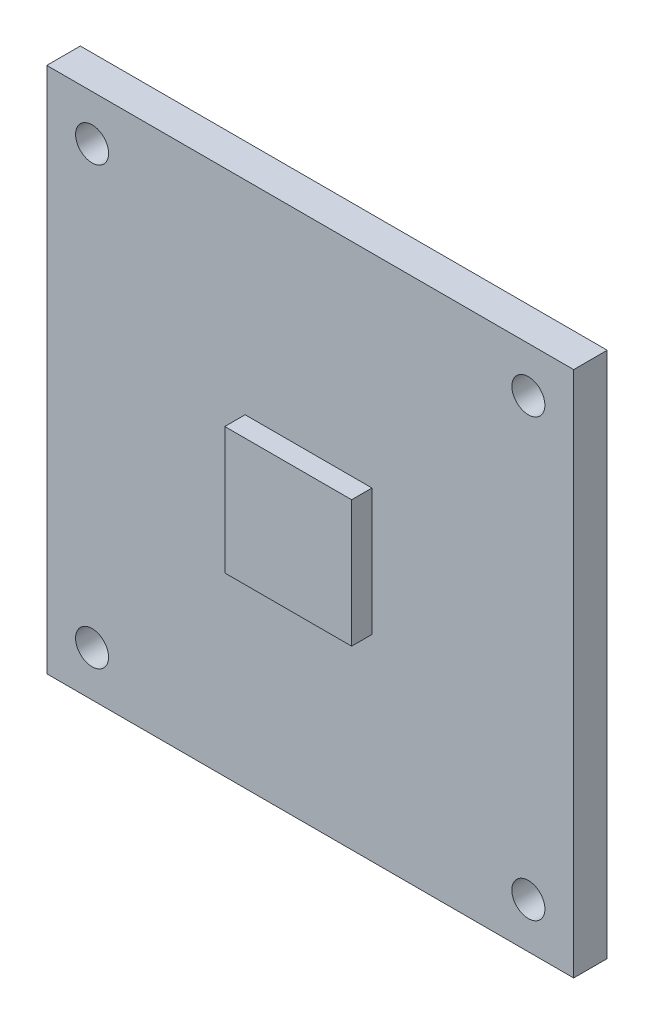
ISO-10303-21;
HEADER;
FILE_DESCRIPTION(('STEP AP214'),'2;1');
FILE_NAME('part.step','',(''),(''),'','','');
FILE_SCHEMA(('AUTOMOTIVE_DESIGN { 1 0 10303 214 1 1 1 1 }'));
ENDSEC;
DATA;
#1=APPLICATION_CONTEXT('core data for automotive mechanical design processes');
#2=APPLICATION_PROTOCOL_DEFINITION('international standard','automotive_design',2000,#1);
#3=PRODUCT_CONTEXT('',#1,'mechanical');
#4=PRODUCT('Part','Part','',(#3));
#5=PRODUCT_RELATED_PRODUCT_CATEGORY('part','',(#4));
#6=PRODUCT_DEFINITION_FORMATION('','',#4);
#7=PRODUCT_DEFINITION_CONTEXT('part definition',#1,'design');
#8=PRODUCT_DEFINITION('design','',#6,#7);
#9=PRODUCT_DEFINITION_SHAPE('','',#8);
#10=(LENGTH_UNIT() NAMED_UNIT(*) SI_UNIT(.MILLI.,.METRE.));
#11=(NAMED_UNIT(*) PLANE_ANGLE_UNIT() SI_UNIT($,.RADIAN.));
#12=(NAMED_UNIT(*) SI_UNIT($,.STERADIAN.) SOLID_ANGLE_UNIT());
#13=UNCERTAINTY_MEASURE_WITH_UNIT(LENGTH_MEASURE(1.E-05),#10,'distance_accuracy_value','');
#14=(GEOMETRIC_REPRESENTATION_CONTEXT(3) GLOBAL_UNCERTAINTY_ASSIGNED_CONTEXT((#13)) GLOBAL_UNIT_ASSIGNED_CONTEXT((#10,
#11,#12)) REPRESENTATION_CONTEXT('',''));
#15=CARTESIAN_POINT('',(0.,0.,0.));
#16=DIRECTION('',(0.,0.,1.));
#17=DIRECTION('',(1.,0.,0.));
#18=AXIS2_PLACEMENT_3D('',#15,#16,#17);
#19=CARTESIAN_POINT('',(0.,0.,0.));
#20=DIRECTION('',(0.,0.,1.));
#21=DIRECTION('',(1.,0.,0.));
#22=AXIS2_PLACEMENT_3D('',#19,#20,#21);
#23=PLANE('',#22);
#24=DIRECTION('',(0.,-1.,0.));
#25=VECTOR('',#24,1.);
#26=CARTESIAN_POINT('',(-3.42905,36.449,0.));
#27=LINE('',#26,#25);
#28=CARTESIAN_POINT('',(-3.42905,36.449,0.));
#29=VERTEX_POINT('',#28);
#30=CARTESIAN_POINT('',(-3.42905,-3.42905,0.));
#31=VERTEX_POINT('',#30);
#32=EDGE_CURVE('E160',#29,#31,#27,.T.);
#33=ORIENTED_EDGE('',*,*,#32,.T.);
#34=DIRECTION('',(1.,0.,0.));
#35=VECTOR('',#34,1.);
#36=CARTESIAN_POINT('',(-3.42905,-3.42905,0.));
#37=LINE('',#36,#35);
#38=CARTESIAN_POINT('',(36.449,-3.42905,0.));
#39=VERTEX_POINT('',#38);
#40=EDGE_CURVE('E173',#31,#39,#37,.T.);
#41=ORIENTED_EDGE('',*,*,#40,.T.);
#42=DIRECTION('',(0.,1.,0.));
#43=VECTOR('',#42,1.);
#44=CARTESIAN_POINT('',(36.449,36.449,0.));
#45=LINE('',#44,#43);
#46=CARTESIAN_POINT('',(36.449,36.449,0.));
#47=VERTEX_POINT('',#46);
#48=EDGE_CURVE('E176',#39,#47,#45,.T.);
#49=ORIENTED_EDGE('',*,*,#48,.T.);
#50=DIRECTION('',(-1.,0.,0.));
#51=VECTOR('',#50,1.);
#52=CARTESIAN_POINT('',(-3.42905,36.449,0.));
#53=LINE('',#52,#51);
#54=EDGE_CURVE('E164',#47,#29,#53,.T.);
#55=ORIENTED_EDGE('',*,*,#54,.T.);
#56=EDGE_LOOP('',(#33,#41,#49,#55));
#57=FACE_BOUND('',#56,.T.);
#58=CARTESIAN_POINT('',(0.,0.,0.));
#59=DIRECTION('',(0.,0.,1.));
#60=DIRECTION('',(1.,0.,0.));
#61=AXIS2_PLACEMENT_3D('',#58,#59,#60);
#62=CIRCLE('',#61,1.24999999999999);
#63=CARTESIAN_POINT('',(1.24999999999999,0.,0.));
#64=VERTEX_POINT('',#63);
#65=EDGE_CURVE('E154',#64,#64,#62,.T.);
#66=ORIENTED_EDGE('',*,*,#65,.F.);
#67=EDGE_LOOP('',(#66));
#68=FACE_BOUND('',#67,.T.);
#69=CARTESIAN_POINT('',(33.02,0.,0.));
#70=DIRECTION('',(0.,0.,1.));
#71=DIRECTION('',(1.,0.,0.));
#72=AXIS2_PLACEMENT_3D('',#69,#70,#71);
#73=CIRCLE('',#72,1.24999999999999);
#74=CARTESIAN_POINT('',(34.27,0.,0.));
#75=VERTEX_POINT('',#74);
#76=EDGE_CURVE('E148',#75,#75,#73,.T.);
#77=ORIENTED_EDGE('',*,*,#76,.F.);
#78=EDGE_LOOP('',(#77));
#79=FACE_BOUND('',#78,.T.);
#80=CARTESIAN_POINT('',(33.02,33.02,0.));
#81=DIRECTION('',(0.,0.,1.));
#82=DIRECTION('',(1.,0.,0.));
#83=AXIS2_PLACEMENT_3D('',#80,#81,#82);
#84=CIRCLE('',#83,1.24999999999999);
#85=CARTESIAN_POINT('',(34.27,33.02,0.));
#86=VERTEX_POINT('',#85);
#87=EDGE_CURVE('E142',#86,#86,#84,.T.);
#88=ORIENTED_EDGE('',*,*,#87,.F.);
#89=EDGE_LOOP('',(#88));
#90=FACE_BOUND('',#89,.T.);
#91=CARTESIAN_POINT('',(0.,33.02,0.));
#92=DIRECTION('',(0.,0.,1.));
#93=DIRECTION('',(1.,0.,0.));
#94=AXIS2_PLACEMENT_3D('',#91,#92,#93);
#95=CIRCLE('',#94,1.24999999999999);
#96=CARTESIAN_POINT('',(1.24999999999999,33.02,0.));
#97=VERTEX_POINT('',#96);
#98=EDGE_CURVE('E132',#97,#97,#95,.T.);
#99=ORIENTED_EDGE('',*,*,#98,.F.);
#100=EDGE_LOOP('',(#99));
#101=FACE_BOUND('',#100,.T.);
#102=DIRECTION('',(1.,0.,0.));
#103=VECTOR('',#102,1.);
#104=CARTESIAN_POINT('',(11.583,11.456,0.));
#105=LINE('',#104,#103);
#106=CARTESIAN_POINT('',(11.583,11.456,0.));
#107=VERTEX_POINT('',#106);
#108=CARTESIAN_POINT('',(21.183,11.456,0.));
#109=VERTEX_POINT('',#108);
#110=EDGE_CURVE('E323',#107,#109,#105,.T.);
#111=ORIENTED_EDGE('',*,*,#110,.F.);
#112=DIRECTION('',(0.,-1.,0.));
#113=VECTOR('',#112,1.);
#114=CARTESIAN_POINT('',(11.583,11.456,0.));
#115=LINE('',#114,#113);
#116=CARTESIAN_POINT('',(11.583,21.056,0.));
#117=VERTEX_POINT('',#116);
#118=EDGE_CURVE('E130',#117,#107,#115,.T.);
#119=ORIENTED_EDGE('',*,*,#118,.F.);
#120=DIRECTION('',(-1.,0.,0.));
#121=VECTOR('',#120,1.);
#122=CARTESIAN_POINT('',(11.583,21.056,0.));
#123=LINE('',#122,#121);
#124=CARTESIAN_POINT('',(21.183,21.056,0.));
#125=VERTEX_POINT('',#124);
#126=EDGE_CURVE('E126',#125,#117,#123,.T.);
#127=ORIENTED_EDGE('',*,*,#126,.F.);
#128=DIRECTION('',(0.,1.,0.));
#129=VECTOR('',#128,1.);
#130=CARTESIAN_POINT('',(21.183,11.456,0.));
#131=LINE('',#130,#129);
#132=EDGE_CURVE('E320',#109,#125,#131,.T.);
#133=ORIENTED_EDGE('',*,*,#132,.F.);
#134=EDGE_LOOP('',(#111,#119,#127,#133));
#135=FACE_BOUND('',#134,.T.);
#136=ADVANCED_FACE('F34',(#57,#68,#79,#90,#101,#135),#23,.T.);
#137=CARTESIAN_POINT('',(-3.42905,36.449,-2.54));
#138=DIRECTION('',(-1.,0.,0.));
#139=DIRECTION('',(0.,0.,1.));
#140=AXIS2_PLACEMENT_3D('',#137,#138,#139);
#141=PLANE('',#140);
#142=ORIENTED_EDGE('',*,*,#32,.F.);
#143=DIRECTION('',(0.,0.,1.));
#144=VECTOR('',#143,1.);
#145=CARTESIAN_POINT('',(-3.42905,36.449,-2.54));
#146=LINE('',#145,#144);
#147=CARTESIAN_POINT('',(-3.42905,36.449,-2.54));
#148=VERTEX_POINT('',#147);
#149=EDGE_CURVE('E11',#148,#29,#146,.T.);
#150=ORIENTED_EDGE('',*,*,#149,.F.);
#151=DIRECTION('',(0.,-1.,0.));
#152=VECTOR('',#151,1.);
#153=CARTESIAN_POINT('',(-3.42905,36.449,-2.54));
#154=LINE('',#153,#152);
#155=CARTESIAN_POINT('',(-3.42905,-3.42905,-2.54));
#156=VERTEX_POINT('',#155);
#157=EDGE_CURVE('E161',#148,#156,#154,.T.);
#158=ORIENTED_EDGE('',*,*,#157,.T.);
#159=DIRECTION('',(0.,0.,1.));
#160=VECTOR('',#159,1.);
#161=CARTESIAN_POINT('',(-3.42905,-3.42905,-2.54));
#162=LINE('',#161,#160);
#163=EDGE_CURVE('E38',#156,#31,#162,.T.);
#164=ORIENTED_EDGE('',*,*,#163,.T.);
#165=EDGE_LOOP('',(#142,#150,#158,#164));
#166=FACE_BOUND('',#165,.T.);
#167=ADVANCED_FACE('F36',(#166),#141,.T.);
#168=CARTESIAN_POINT('',(-3.42905,36.449,-2.54));
#169=DIRECTION('',(0.,1.,0.));
#170=DIRECTION('',(0.,0.,1.));
#171=AXIS2_PLACEMENT_3D('',#168,#169,#170);
#172=PLANE('',#171);
#173=ORIENTED_EDGE('',*,*,#54,.F.);
#174=DIRECTION('',(0.,0.,1.));
#175=VECTOR('',#174,1.);
#176=CARTESIAN_POINT('',(36.449,36.449,-2.54));
#177=LINE('',#176,#175);
#178=CARTESIAN_POINT('',(36.449,36.449,-2.54));
#179=VERTEX_POINT('',#178);
#180=EDGE_CURVE('E43',#179,#47,#177,.T.);
#181=ORIENTED_EDGE('',*,*,#180,.F.);
#182=DIRECTION('',(-1.,0.,0.));
#183=VECTOR('',#182,1.);
#184=CARTESIAN_POINT('',(-3.42905,36.449,-2.54));
#185=LINE('',#184,#183);
#186=EDGE_CURVE('E169',#179,#148,#185,.T.);
#187=ORIENTED_EDGE('',*,*,#186,.T.);
#188=ORIENTED_EDGE('',*,*,#149,.T.);
#189=EDGE_LOOP('',(#173,#181,#187,#188));
#190=FACE_BOUND('',#189,.T.);
#191=ADVANCED_FACE('F186',(#190),#172,.T.);
#192=CARTESIAN_POINT('',(36.449,36.449,-2.54));
#193=DIRECTION('',(1.,0.,0.));
#194=DIRECTION('',(0.,0.,-1.));
#195=AXIS2_PLACEMENT_3D('',#192,#193,#194);
#196=PLANE('',#195);
#197=ORIENTED_EDGE('',*,*,#48,.F.);
#198=DIRECTION('',(0.,0.,1.));
#199=VECTOR('',#198,1.);
#200=CARTESIAN_POINT('',(36.449,-3.42905,-2.54));
#201=LINE('',#200,#199);
#202=CARTESIAN_POINT('',(36.449,-3.42905,-2.54));
#203=VERTEX_POINT('',#202);
#204=EDGE_CURVE('E181',#203,#39,#201,.T.);
#205=ORIENTED_EDGE('',*,*,#204,.F.);
#206=DIRECTION('',(0.,1.,0.));
#207=VECTOR('',#206,1.);
#208=CARTESIAN_POINT('',(36.449,36.449,-2.54));
#209=LINE('',#208,#207);
#210=EDGE_CURVE('E166',#203,#179,#209,.T.);
#211=ORIENTED_EDGE('',*,*,#210,.T.);
#212=ORIENTED_EDGE('',*,*,#180,.T.);
#213=EDGE_LOOP('',(#197,#205,#211,#212));
#214=FACE_BOUND('',#213,.T.);
#215=ADVANCED_FACE('F190',(#214),#196,.T.);
#216=CARTESIAN_POINT('',(-3.42905,-3.42905,-2.54));
#217=DIRECTION('',(0.,-1.,0.));
#218=DIRECTION('',(0.,0.,-1.));
#219=AXIS2_PLACEMENT_3D('',#216,#217,#218);
#220=PLANE('',#219);
#221=ORIENTED_EDGE('',*,*,#40,.F.);
#222=ORIENTED_EDGE('',*,*,#163,.F.);
#223=DIRECTION('',(1.,0.,0.));
#224=VECTOR('',#223,1.);
#225=CARTESIAN_POINT('',(-3.42905,-3.42905,-2.54));
#226=LINE('',#225,#224);
#227=EDGE_CURVE('E163',#156,#203,#226,.T.);
#228=ORIENTED_EDGE('',*,*,#227,.T.);
#229=ORIENTED_EDGE('',*,*,#204,.T.);
#230=EDGE_LOOP('',(#221,#222,#228,#229));
#231=FACE_BOUND('',#230,.T.);
#232=ADVANCED_FACE('F183',(#231),#220,.T.);
#233=CARTESIAN_POINT('',(0.,0.,-2.54));
#234=DIRECTION('',(0.,0.,1.));
#235=DIRECTION('',(1.,0.,0.));
#236=AXIS2_PLACEMENT_3D('',#233,#234,#235);
#237=PLANE('',#236);
#238=CARTESIAN_POINT('',(0.,33.02,-2.54));
#239=DIRECTION('',(0.,0.,1.));
#240=DIRECTION('',(1.,0.,0.));
#241=AXIS2_PLACEMENT_3D('',#238,#239,#240);
#242=CIRCLE('',#241,1.25);
#243=CARTESIAN_POINT('',(1.25,33.02,-2.54));
#244=VERTEX_POINT('',#243);
#245=EDGE_CURVE('E135',#244,#244,#242,.T.);
#246=ORIENTED_EDGE('',*,*,#245,.T.);
#247=EDGE_LOOP('',(#246));
#248=FACE_BOUND('',#247,.T.);
#249=CARTESIAN_POINT('',(33.02,33.02,-2.54));
#250=DIRECTION('',(0.,0.,1.));
#251=DIRECTION('',(1.,0.,0.));
#252=AXIS2_PLACEMENT_3D('',#249,#250,#251);
#253=CIRCLE('',#252,1.25);
#254=CARTESIAN_POINT('',(34.27,33.02,-2.54));
#255=VERTEX_POINT('',#254);
#256=EDGE_CURVE('E145',#255,#255,#253,.T.);
#257=ORIENTED_EDGE('',*,*,#256,.T.);
#258=EDGE_LOOP('',(#257));
#259=FACE_BOUND('',#258,.T.);
#260=CARTESIAN_POINT('',(33.02,0.,-2.54));
#261=DIRECTION('',(0.,0.,1.));
#262=DIRECTION('',(1.,0.,0.));
#263=AXIS2_PLACEMENT_3D('',#260,#261,#262);
#264=CIRCLE('',#263,1.25);
#265=CARTESIAN_POINT('',(34.27,0.,-2.54));
#266=VERTEX_POINT('',#265);
#267=EDGE_CURVE('E151',#266,#266,#264,.T.);
#268=ORIENTED_EDGE('',*,*,#267,.T.);
#269=EDGE_LOOP('',(#268));
#270=FACE_BOUND('',#269,.T.);
#271=CARTESIAN_POINT('',(0.,0.,-2.54));
#272=DIRECTION('',(0.,0.,1.));
#273=DIRECTION('',(1.,0.,0.));
#274=AXIS2_PLACEMENT_3D('',#271,#272,#273);
#275=CIRCLE('',#274,1.25);
#276=CARTESIAN_POINT('',(1.25,0.,-2.54));
#277=VERTEX_POINT('',#276);
#278=EDGE_CURVE('E157',#277,#277,#275,.T.);
#279=ORIENTED_EDGE('',*,*,#278,.T.);
#280=EDGE_LOOP('',(#279));
#281=FACE_BOUND('',#280,.T.);
#282=ORIENTED_EDGE('',*,*,#157,.F.);
#283=ORIENTED_EDGE('',*,*,#186,.F.);
#284=ORIENTED_EDGE('',*,*,#210,.F.);
#285=ORIENTED_EDGE('',*,*,#227,.F.);
#286=EDGE_LOOP('',(#282,#283,#284,#285));
#287=FACE_BOUND('',#286,.T.);
#288=ADVANCED_FACE('F192',(#248,#259,#270,#281,#287),#237,.F.);
#289=CARTESIAN_POINT('',(0.,0.,0.));
#290=DIRECTION('',(0.,0.,1.));
#291=DIRECTION('',(1.,0.,0.));
#292=AXIS2_PLACEMENT_3D('',#289,#290,#291);
#293=CYLINDRICAL_SURFACE('',#292,1.24999999999999);
#294=ORIENTED_EDGE('',*,*,#278,.F.);
#295=EDGE_LOOP('',(#294));
#296=FACE_BOUND('',#295,.T.);
#297=ORIENTED_EDGE('',*,*,#65,.T.);
#298=EDGE_LOOP('',(#297));
#299=FACE_BOUND('',#298,.T.);
#300=ADVANCED_FACE('F194',(#296,#299),#293,.F.);
#301=CARTESIAN_POINT('',(33.02,0.,0.));
#302=DIRECTION('',(0.,0.,1.));
#303=DIRECTION('',(1.,0.,0.));
#304=AXIS2_PLACEMENT_3D('',#301,#302,#303);
#305=CYLINDRICAL_SURFACE('',#304,1.24999999999999);
#306=ORIENTED_EDGE('',*,*,#267,.F.);
#307=EDGE_LOOP('',(#306));
#308=FACE_BOUND('',#307,.T.);
#309=ORIENTED_EDGE('',*,*,#76,.T.);
#310=EDGE_LOOP('',(#309));
#311=FACE_BOUND('',#310,.T.);
#312=ADVANCED_FACE('F201',(#308,#311),#305,.F.);
#313=CARTESIAN_POINT('',(33.02,33.02,0.));
#314=DIRECTION('',(0.,0.,1.));
#315=DIRECTION('',(1.,0.,0.));
#316=AXIS2_PLACEMENT_3D('',#313,#314,#315);
#317=CYLINDRICAL_SURFACE('',#316,1.24999999999999);
#318=ORIENTED_EDGE('',*,*,#256,.F.);
#319=EDGE_LOOP('',(#318));
#320=FACE_BOUND('',#319,.T.);
#321=ORIENTED_EDGE('',*,*,#87,.T.);
#322=EDGE_LOOP('',(#321));
#323=FACE_BOUND('',#322,.T.);
#324=ADVANCED_FACE('F243',(#320,#323),#317,.F.);
#325=CARTESIAN_POINT('',(0.,33.02,0.));
#326=DIRECTION('',(0.,0.,1.));
#327=DIRECTION('',(1.,0.,0.));
#328=AXIS2_PLACEMENT_3D('',#325,#326,#327);
#329=CYLINDRICAL_SURFACE('',#328,1.24999999999999);
#330=ORIENTED_EDGE('',*,*,#245,.F.);
#331=EDGE_LOOP('',(#330));
#332=FACE_BOUND('',#331,.T.);
#333=ORIENTED_EDGE('',*,*,#98,.T.);
#334=EDGE_LOOP('',(#333));
#335=FACE_BOUND('',#334,.T.);
#336=ADVANCED_FACE('F254',(#332,#335),#329,.F.);
#337=CARTESIAN_POINT('',(11.583,11.456,1.54));
#338=DIRECTION('',(1.,0.,0.));
#339=DIRECTION('',(0.,0.,-1.));
#340=AXIS2_PLACEMENT_3D('',#337,#338,#339);
#341=PLANE('',#340);
#342=ORIENTED_EDGE('',*,*,#118,.T.);
#343=DIRECTION('',(0.,0.,-1.));
#344=VECTOR('',#343,1.);
#345=CARTESIAN_POINT('',(11.583,11.456,1.54));
#346=LINE('',#345,#344);
#347=CARTESIAN_POINT('',(11.583,11.456,1.54));
#348=VERTEX_POINT('',#347);
#349=EDGE_CURVE('E111',#348,#107,#346,.T.);
#350=ORIENTED_EDGE('',*,*,#349,.F.);
#351=DIRECTION('',(0.,-1.,0.));
#352=VECTOR('',#351,1.);
#353=CARTESIAN_POINT('',(11.583,11.456,1.54));
#354=LINE('',#353,#352);
#355=CARTESIAN_POINT('',(11.583,21.056,1.54));
#356=VERTEX_POINT('',#355);
#357=EDGE_CURVE('E118',#356,#348,#354,.T.);
#358=ORIENTED_EDGE('',*,*,#357,.F.);
#359=DIRECTION('',(0.,0.,-1.));
#360=VECTOR('',#359,1.);
#361=CARTESIAN_POINT('',(11.583,21.056,1.54));
#362=LINE('',#361,#360);
#363=EDGE_CURVE('E317',#356,#117,#362,.T.);
#364=ORIENTED_EDGE('',*,*,#363,.T.);
#365=EDGE_LOOP('',(#342,#350,#358,#364));
#366=FACE_BOUND('',#365,.T.);
#367=ADVANCED_FACE('F128',(#366),#341,.F.);
#368=CARTESIAN_POINT('',(11.583,11.456,1.54));
#369=DIRECTION('',(0.,1.,0.));
#370=DIRECTION('',(-1.,0.,0.));
#371=AXIS2_PLACEMENT_3D('',#368,#369,#370);
#372=PLANE('',#371);
#373=ORIENTED_EDGE('',*,*,#110,.T.);
#374=DIRECTION('',(0.,0.,-1.));
#375=VECTOR('',#374,1.);
#376=CARTESIAN_POINT('',(21.183,11.456,1.54));
#377=LINE('',#376,#375);
#378=CARTESIAN_POINT('',(21.183,11.456,1.54));
#379=VERTEX_POINT('',#378);
#380=EDGE_CURVE('E114',#379,#109,#377,.T.);
#381=ORIENTED_EDGE('',*,*,#380,.F.);
#382=DIRECTION('',(1.,0.,0.));
#383=VECTOR('',#382,1.);
#384=CARTESIAN_POINT('',(11.583,11.456,1.54));
#385=LINE('',#384,#383);
#386=EDGE_CURVE('E107',#348,#379,#385,.T.);
#387=ORIENTED_EDGE('',*,*,#386,.F.);
#388=ORIENTED_EDGE('',*,*,#349,.T.);
#389=EDGE_LOOP('',(#373,#381,#387,#388));
#390=FACE_BOUND('',#389,.T.);
#391=ADVANCED_FACE('F109',(#390),#372,.F.);
#392=CARTESIAN_POINT('',(21.183,11.456,1.54));
#393=DIRECTION('',(-1.,0.,0.));
#394=DIRECTION('',(0.,0.,1.));
#395=AXIS2_PLACEMENT_3D('',#392,#393,#394);
#396=PLANE('',#395);
#397=ORIENTED_EDGE('',*,*,#132,.T.);
#398=DIRECTION('',(0.,0.,-1.));
#399=VECTOR('',#398,1.);
#400=CARTESIAN_POINT('',(21.183,21.056,1.54));
#401=LINE('',#400,#399);
#402=CARTESIAN_POINT('',(21.183,21.056,1.54));
#403=VERTEX_POINT('',#402);
#404=EDGE_CURVE('E51',#403,#125,#401,.T.);
#405=ORIENTED_EDGE('',*,*,#404,.F.);
#406=DIRECTION('',(0.,1.,0.));
#407=VECTOR('',#406,1.);
#408=CARTESIAN_POINT('',(21.183,11.456,1.54));
#409=LINE('',#408,#407);
#410=EDGE_CURVE('E117',#379,#403,#409,.T.);
#411=ORIENTED_EDGE('',*,*,#410,.F.);
#412=ORIENTED_EDGE('',*,*,#380,.T.);
#413=EDGE_LOOP('',(#397,#405,#411,#412));
#414=FACE_BOUND('',#413,.T.);
#415=ADVANCED_FACE('F286',(#414),#396,.F.);
#416=CARTESIAN_POINT('',(11.583,21.056,1.54));
#417=DIRECTION('',(0.,-1.,0.));
#418=DIRECTION('',(0.,0.,-1.));
#419=AXIS2_PLACEMENT_3D('',#416,#417,#418);
#420=PLANE('',#419);
#421=ORIENTED_EDGE('',*,*,#126,.T.);
#422=ORIENTED_EDGE('',*,*,#363,.F.);
#423=DIRECTION('',(-1.,0.,0.));
#424=VECTOR('',#423,1.);
#425=CARTESIAN_POINT('',(11.583,21.056,1.54));
#426=LINE('',#425,#424);
#427=EDGE_CURVE('E122',#403,#356,#426,.T.);
#428=ORIENTED_EDGE('',*,*,#427,.F.);
#429=ORIENTED_EDGE('',*,*,#404,.T.);
#430=EDGE_LOOP('',(#421,#422,#428,#429));
#431=FACE_BOUND('',#430,.T.);
#432=ADVANCED_FACE('F295',(#431),#420,.F.);
#433=CARTESIAN_POINT('',(0.,0.,1.54));
#434=DIRECTION('',(0.,0.,-1.));
#435=DIRECTION('',(-1.,0.,0.));
#436=AXIS2_PLACEMENT_3D('',#433,#434,#435);
#437=PLANE('',#436);
#438=ORIENTED_EDGE('',*,*,#357,.T.);
#439=ORIENTED_EDGE('',*,*,#386,.T.);
#440=ORIENTED_EDGE('',*,*,#410,.T.);
#441=ORIENTED_EDGE('',*,*,#427,.T.);
#442=EDGE_LOOP('',(#438,#439,#440,#441));
#443=FACE_BOUND('',#442,.T.);
#444=ADVANCED_FACE('F121',(#443),#437,.F.);
#445=CLOSED_SHELL('',(#136,#167,#191,#215,#232,#288,#300,#312,#324,#336,#367,#391,#415,#432,#444));
#446=MANIFOLD_SOLID_BREP('B2',#445);
#447=ADVANCED_BREP_SHAPE_REPRESENTATION('',(#18,#446),#14);
#448=SHAPE_DEFINITION_REPRESENTATION(#9,#447);
ENDSEC;
END-ISO-10303-21;
